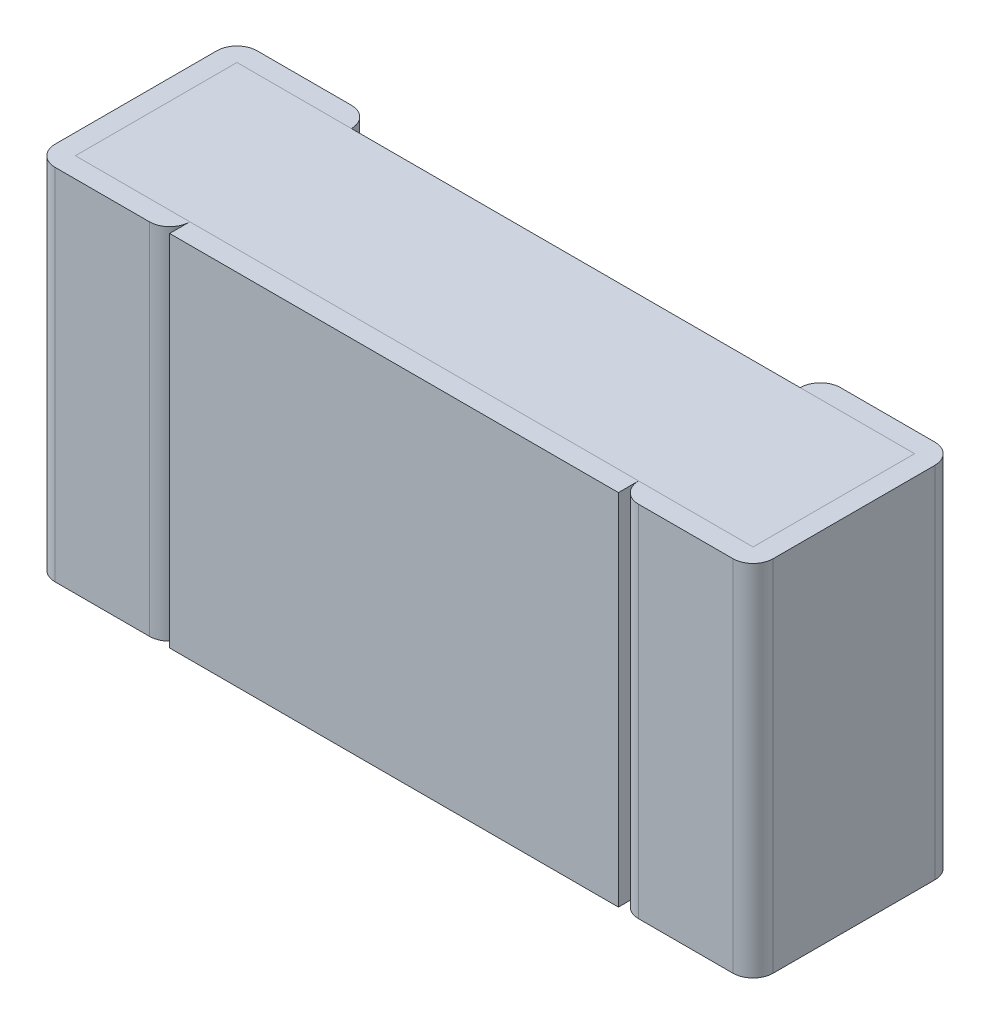
ISO-10303-21;
HEADER;
FILE_DESCRIPTION(('STEP AP214'),'2;1');
FILE_NAME('part.step','',(''),(''),'','','');
FILE_SCHEMA(('AUTOMOTIVE_DESIGN { 1 0 10303 214 1 1 1 1 }'));
ENDSEC;
DATA;
#1=APPLICATION_CONTEXT('core data for automotive mechanical design processes');
#2=APPLICATION_PROTOCOL_DEFINITION('international standard','automotive_design',2000,#1);
#3=PRODUCT_CONTEXT('',#1,'mechanical');
#4=PRODUCT('Part','Part','',(#3));
#5=PRODUCT_RELATED_PRODUCT_CATEGORY('part','',(#4));
#6=PRODUCT_DEFINITION_FORMATION('','',#4);
#7=PRODUCT_DEFINITION_CONTEXT('part definition',#1,'design');
#8=PRODUCT_DEFINITION('design','',#6,#7);
#9=PRODUCT_DEFINITION_SHAPE('','',#8);
#10=(LENGTH_UNIT() NAMED_UNIT(*) SI_UNIT(.MILLI.,.METRE.));
#11=(NAMED_UNIT(*) PLANE_ANGLE_UNIT() SI_UNIT($,.RADIAN.));
#12=(NAMED_UNIT(*) SI_UNIT($,.STERADIAN.) SOLID_ANGLE_UNIT());
#13=UNCERTAINTY_MEASURE_WITH_UNIT(LENGTH_MEASURE(1.E-05),#10,'distance_accuracy_value','');
#14=(GEOMETRIC_REPRESENTATION_CONTEXT(3) GLOBAL_UNCERTAINTY_ASSIGNED_CONTEXT((#13)) GLOBAL_UNIT_ASSIGNED_CONTEXT((#10,
#11,#12)) REPRESENTATION_CONTEXT('',''));
#15=CARTESIAN_POINT('',(0.,0.,0.));
#16=DIRECTION('',(0.,0.,1.));
#17=DIRECTION('',(1.,0.,0.));
#18=AXIS2_PLACEMENT_3D('',#15,#16,#17);
#19=CARTESIAN_POINT('',(-0.5,-0.4,0.45));
#20=DIRECTION('',(0.,0.,1.));
#21=DIRECTION('',(1.,0.,0.));
#22=AXIS2_PLACEMENT_3D('',#19,#20,#21);
#23=PLANE('',#22);
#24=DIRECTION('',(0.,1.,0.));
#25=VECTOR('',#24,1.);
#26=CARTESIAN_POINT('',(-0.5,-0.4,0.45));
#27=LINE('',#26,#25);
#28=CARTESIAN_POINT('',(-0.5,-0.4,0.45));
#29=VERTEX_POINT('',#28);
#30=CARTESIAN_POINT('',(-0.5,0.4,0.45));
#31=VERTEX_POINT('',#30);
#32=EDGE_CURVE('E289',#29,#31,#27,.T.);
#33=ORIENTED_EDGE('',*,*,#32,.F.);
#34=DIRECTION('',(1.,0.,0.));
#35=VECTOR('',#34,1.);
#36=CARTESIAN_POINT('',(-0.5,-0.4,0.45));
#37=LINE('',#36,#35);
#38=CARTESIAN_POINT('',(0.5,-0.4,0.45));
#39=VERTEX_POINT('',#38);
#40=EDGE_CURVE('E266',#29,#39,#37,.T.);
#41=ORIENTED_EDGE('',*,*,#40,.T.);
#42=DIRECTION('',(0.,1.,0.));
#43=VECTOR('',#42,1.);
#44=CARTESIAN_POINT('',(0.5,-0.4,0.45));
#45=LINE('',#44,#43);
#46=CARTESIAN_POINT('',(0.5,0.4,0.45));
#47=VERTEX_POINT('',#46);
#48=EDGE_CURVE('E11',#39,#47,#45,.T.);
#49=ORIENTED_EDGE('',*,*,#48,.T.);
#50=DIRECTION('',(1.,0.,0.));
#51=VECTOR('',#50,1.);
#52=CARTESIAN_POINT('',(-0.5,0.4,0.45));
#53=LINE('',#52,#51);
#54=EDGE_CURVE('E313',#31,#47,#53,.T.);
#55=ORIENTED_EDGE('',*,*,#54,.F.);
#56=EDGE_LOOP('',(#33,#41,#49,#55));
#57=FACE_BOUND('',#56,.T.);
#58=ADVANCED_FACE('F17',(#57),#23,.T.);
#59=CARTESIAN_POINT('',(0.5,-0.4,0.405));
#60=DIRECTION('',(1.,0.,0.));
#61=DIRECTION('',(0.,1.,0.));
#62=AXIS2_PLACEMENT_3D('',#59,#60,#61);
#63=PLANE('',#62);
#64=DIRECTION('',(0.,0.,1.));
#65=VECTOR('',#64,1.);
#66=CARTESIAN_POINT('',(0.5,-0.4,0.405));
#67=LINE('',#66,#65);
#68=CARTESIAN_POINT('',(0.5,-0.4,0.405));
#69=VERTEX_POINT('',#68);
#70=EDGE_CURVE('E270',#69,#39,#67,.T.);
#71=ORIENTED_EDGE('',*,*,#70,.F.);
#72=DIRECTION('',(0.,1.,0.));
#73=VECTOR('',#72,1.);
#74=CARTESIAN_POINT('',(0.5,-0.4,0.405));
#75=LINE('',#74,#73);
#76=CARTESIAN_POINT('',(0.5,0.4,0.405));
#77=VERTEX_POINT('',#76);
#78=EDGE_CURVE('E28',#69,#77,#75,.T.);
#79=ORIENTED_EDGE('',*,*,#78,.T.);
#80=DIRECTION('',(0.,0.,1.));
#81=VECTOR('',#80,1.);
#82=CARTESIAN_POINT('',(0.5,0.4,0.405));
#83=LINE('',#82,#81);
#84=EDGE_CURVE('E427',#77,#47,#83,.T.);
#85=ORIENTED_EDGE('',*,*,#84,.T.);
#86=ORIENTED_EDGE('',*,*,#48,.F.);
#87=EDGE_LOOP('',(#71,#79,#85,#86));
#88=FACE_BOUND('',#87,.T.);
#89=ADVANCED_FACE('F561',(#88),#63,.T.);
#90=CARTESIAN_POINT('',(0.545,-0.4,0.405));
#91=DIRECTION('',(0.,1.,0.));
#92=DIRECTION('',(-1.,0.,0.));
#93=AXIS2_PLACEMENT_3D('',#90,#91,#92);
#94=CYLINDRICAL_SURFACE('',#93,0.045);
#95=CARTESIAN_POINT('',(0.545,-0.4,0.405));
#96=DIRECTION('',(0.,1.,0.));
#97=DIRECTION('',(0.,0.,1.));
#98=AXIS2_PLACEMENT_3D('',#95,#96,#97);
#99=CIRCLE('',#98,0.045);
#100=CARTESIAN_POINT('',(0.545,-0.4,0.45));
#101=VERTEX_POINT('',#100);
#102=EDGE_CURVE('E394',#69,#101,#99,.T.);
#103=ORIENTED_EDGE('',*,*,#102,.T.);
#104=DIRECTION('',(0.,1.,0.));
#105=VECTOR('',#104,1.);
#106=CARTESIAN_POINT('',(0.545,-0.4,0.45));
#107=LINE('',#106,#105);
#108=CARTESIAN_POINT('',(0.545,0.4,0.45));
#109=VERTEX_POINT('',#108);
#110=EDGE_CURVE('E458',#101,#109,#107,.T.);
#111=ORIENTED_EDGE('',*,*,#110,.T.);
#112=CARTESIAN_POINT('',(0.545,0.4,0.405));
#113=DIRECTION('',(0.,1.,0.));
#114=DIRECTION('',(0.,0.,1.));
#115=AXIS2_PLACEMENT_3D('',#112,#113,#114);
#116=CIRCLE('',#115,0.045);
#117=EDGE_CURVE('E405',#77,#109,#116,.T.);
#118=ORIENTED_EDGE('',*,*,#117,.F.);
#119=ORIENTED_EDGE('',*,*,#78,.F.);
#120=EDGE_LOOP('',(#103,#111,#118,#119));
#121=FACE_BOUND('',#120,.T.);
#122=ADVANCED_FACE('F526',(#121),#94,.T.);
#123=CARTESIAN_POINT('',(0.5,-0.4,0.45));
#124=DIRECTION('',(0.,0.,1.));
#125=DIRECTION('',(1.,0.,0.));
#126=AXIS2_PLACEMENT_3D('',#123,#124,#125);
#127=PLANE('',#126);
#128=DIRECTION('',(1.,0.,0.));
#129=VECTOR('',#128,1.);
#130=CARTESIAN_POINT('',(0.5,0.4,0.45));
#131=LINE('',#130,#129);
#132=CARTESIAN_POINT('',(0.755,0.4,0.45));
#133=VERTEX_POINT('',#132);
#134=EDGE_CURVE('E409',#109,#133,#131,.T.);
#135=ORIENTED_EDGE('',*,*,#134,.F.);
#136=ORIENTED_EDGE('',*,*,#110,.F.);
#137=DIRECTION('',(1.,0.,0.));
#138=VECTOR('',#137,1.);
#139=CARTESIAN_POINT('',(0.5,-0.4,0.45));
#140=LINE('',#139,#138);
#141=CARTESIAN_POINT('',(0.755,-0.4,0.45));
#142=VERTEX_POINT('',#141);
#143=EDGE_CURVE('E390',#101,#142,#140,.T.);
#144=ORIENTED_EDGE('',*,*,#143,.T.);
#145=DIRECTION('',(0.,1.,0.));
#146=VECTOR('',#145,1.);
#147=CARTESIAN_POINT('',(0.755,-0.4,0.45));
#148=LINE('',#147,#146);
#149=EDGE_CURVE('E322',#142,#133,#148,.T.);
#150=ORIENTED_EDGE('',*,*,#149,.T.);
#151=EDGE_LOOP('',(#135,#136,#144,#150));
#152=FACE_BOUND('',#151,.T.);
#153=ADVANCED_FACE('F523',(#152),#127,.T.);
#154=CARTESIAN_POINT('',(0.755,-0.4,0.405));
#155=DIRECTION('',(0.,1.,0.));
#156=DIRECTION('',(1.,0.,0.));
#157=AXIS2_PLACEMENT_3D('',#154,#155,#156);
#158=CYLINDRICAL_SURFACE('',#157,0.045);
#159=DIRECTION('',(0.,1.,0.));
#160=VECTOR('',#159,1.);
#161=CARTESIAN_POINT('',(0.8,-0.4,0.405));
#162=LINE('',#161,#160);
#163=CARTESIAN_POINT('',(0.8,-0.4,0.405));
#164=VERTEX_POINT('',#163);
#165=CARTESIAN_POINT('',(0.8,0.4,0.405));
#166=VERTEX_POINT('',#165);
#167=EDGE_CURVE('E319',#164,#166,#162,.T.);
#168=ORIENTED_EDGE('',*,*,#167,.T.);
#169=CARTESIAN_POINT('',(0.755,0.4,0.405));
#170=DIRECTION('',(0.,-1.,0.));
#171=DIRECTION('',(0.,0.,1.));
#172=AXIS2_PLACEMENT_3D('',#169,#170,#171);
#173=CIRCLE('',#172,0.045);
#174=EDGE_CURVE('E450',#166,#133,#173,.T.);
#175=ORIENTED_EDGE('',*,*,#174,.T.);
#176=ORIENTED_EDGE('',*,*,#149,.F.);
#177=CARTESIAN_POINT('',(0.755,-0.4,0.405));
#178=DIRECTION('',(0.,-1.,0.));
#179=DIRECTION('',(0.,0.,1.));
#180=AXIS2_PLACEMENT_3D('',#177,#178,#179);
#181=CIRCLE('',#180,0.045);
#182=EDGE_CURVE('E395',#164,#142,#181,.T.);
#183=ORIENTED_EDGE('',*,*,#182,.F.);
#184=EDGE_LOOP('',(#168,#175,#176,#183));
#185=FACE_BOUND('',#184,.T.);
#186=ADVANCED_FACE('F511',(#185),#158,.T.);
#187=CARTESIAN_POINT('',(0.8,-0.4,0.));
#188=DIRECTION('',(1.,0.,0.));
#189=DIRECTION('',(0.,1.,0.));
#190=AXIS2_PLACEMENT_3D('',#187,#188,#189);
#191=PLANE('',#190);
#192=DIRECTION('',(0.,0.,1.));
#193=VECTOR('',#192,1.);
#194=CARTESIAN_POINT('',(0.8,-0.4,0.));
#195=LINE('',#194,#193);
#196=CARTESIAN_POINT('',(0.8,-0.4,0.045));
#197=VERTEX_POINT('',#196);
#198=EDGE_CURVE('E380',#197,#164,#195,.T.);
#199=ORIENTED_EDGE('',*,*,#198,.F.);
#200=DIRECTION('',(0.,1.,0.));
#201=VECTOR('',#200,1.);
#202=CARTESIAN_POINT('',(0.8,-0.4,0.045));
#203=LINE('',#202,#201);
#204=CARTESIAN_POINT('',(0.8,0.4,0.045));
#205=VERTEX_POINT('',#204);
#206=EDGE_CURVE('E323',#197,#205,#203,.T.);
#207=ORIENTED_EDGE('',*,*,#206,.T.);
#208=DIRECTION('',(0.,0.,1.));
#209=VECTOR('',#208,1.);
#210=CARTESIAN_POINT('',(0.8,0.4,0.));
#211=LINE('',#210,#209);
#212=EDGE_CURVE('E248',#205,#166,#211,.T.);
#213=ORIENTED_EDGE('',*,*,#212,.T.);
#214=ORIENTED_EDGE('',*,*,#167,.F.);
#215=EDGE_LOOP('',(#199,#207,#213,#214));
#216=FACE_BOUND('',#215,.T.);
#217=ADVANCED_FACE('F517',(#216),#191,.T.);
#218=CARTESIAN_POINT('',(0.755,-0.4,0.045));
#219=DIRECTION('',(0.,1.,0.));
#220=DIRECTION('',(1.,0.,0.));
#221=AXIS2_PLACEMENT_3D('',#218,#219,#220);
#222=CYLINDRICAL_SURFACE('',#221,0.045);
#223=CARTESIAN_POINT('',(0.755,-0.4,0.045));
#224=DIRECTION('',(0.,1.,0.));
#225=DIRECTION('',(0.,0.,1.));
#226=AXIS2_PLACEMENT_3D('',#223,#224,#225);
#227=CIRCLE('',#226,0.045);
#228=CARTESIAN_POINT('',(0.755,-0.4,0.));
#229=VERTEX_POINT('',#228);
#230=EDGE_CURVE('E376',#197,#229,#227,.T.);
#231=ORIENTED_EDGE('',*,*,#230,.T.);
#232=DIRECTION('',(0.,1.,0.));
#233=VECTOR('',#232,1.);
#234=CARTESIAN_POINT('',(0.755,-0.4,0.));
#235=LINE('',#234,#233);
#236=CARTESIAN_POINT('',(0.755,0.4,0.));
#237=VERTEX_POINT('',#236);
#238=EDGE_CURVE('E352',#229,#237,#235,.T.);
#239=ORIENTED_EDGE('',*,*,#238,.T.);
#240=CARTESIAN_POINT('',(0.755,0.4,0.045));
#241=DIRECTION('',(0.,1.,0.));
#242=DIRECTION('',(0.,0.,1.));
#243=AXIS2_PLACEMENT_3D('',#240,#241,#242);
#244=CIRCLE('',#243,0.045);
#245=EDGE_CURVE('E372',#205,#237,#244,.T.);
#246=ORIENTED_EDGE('',*,*,#245,.F.);
#247=ORIENTED_EDGE('',*,*,#206,.F.);
#248=EDGE_LOOP('',(#231,#239,#246,#247));
#249=FACE_BOUND('',#248,.T.);
#250=ADVANCED_FACE('F585',(#249),#222,.T.);
#251=CARTESIAN_POINT('',(0.5,-0.4,0.));
#252=DIRECTION('',(0.,0.,1.));
#253=DIRECTION('',(1.,0.,0.));
#254=AXIS2_PLACEMENT_3D('',#251,#252,#253);
#255=PLANE('',#254);
#256=ORIENTED_EDGE('',*,*,#238,.F.);
#257=DIRECTION('',(1.,0.,0.));
#258=VECTOR('',#257,1.);
#259=CARTESIAN_POINT('',(0.5,-0.4,0.));
#260=LINE('',#259,#258);
#261=CARTESIAN_POINT('',(0.545,-0.4,0.));
#262=VERTEX_POINT('',#261);
#263=EDGE_CURVE('E363',#262,#229,#260,.T.);
#264=ORIENTED_EDGE('',*,*,#263,.F.);
#265=DIRECTION('',(0.,1.,0.));
#266=VECTOR('',#265,1.);
#267=CARTESIAN_POINT('',(0.545,-0.4,0.));
#268=LINE('',#267,#266);
#269=CARTESIAN_POINT('',(0.545,0.4,0.));
#270=VERTEX_POINT('',#269);
#271=EDGE_CURVE('E369',#262,#270,#268,.T.);
#272=ORIENTED_EDGE('',*,*,#271,.T.);
#273=DIRECTION('',(1.,0.,0.));
#274=VECTOR('',#273,1.);
#275=CARTESIAN_POINT('',(0.5,0.4,0.));
#276=LINE('',#275,#274);
#277=EDGE_CURVE('E328',#270,#237,#276,.T.);
#278=ORIENTED_EDGE('',*,*,#277,.T.);
#279=EDGE_LOOP('',(#256,#264,#272,#278));
#280=FACE_BOUND('',#279,.T.);
#281=ADVANCED_FACE('F579',(#280),#255,.F.);
#282=CARTESIAN_POINT('',(0.545,-0.4,0.045));
#283=DIRECTION('',(0.,1.,0.));
#284=DIRECTION('',(-1.,0.,0.));
#285=AXIS2_PLACEMENT_3D('',#282,#283,#284);
#286=CYLINDRICAL_SURFACE('',#285,0.045);
#287=DIRECTION('',(0.,1.,0.));
#288=VECTOR('',#287,1.);
#289=CARTESIAN_POINT('',(0.5,-0.4,0.045));
#290=LINE('',#289,#288);
#291=CARTESIAN_POINT('',(0.5,-0.4,0.045));
#292=VERTEX_POINT('',#291);
#293=CARTESIAN_POINT('',(0.5,0.4,0.045));
#294=VERTEX_POINT('',#293);
#295=EDGE_CURVE('E381',#292,#294,#290,.T.);
#296=ORIENTED_EDGE('',*,*,#295,.T.);
#297=CARTESIAN_POINT('',(0.545,0.4,0.045));
#298=DIRECTION('',(0.,-1.,0.));
#299=DIRECTION('',(0.,0.,1.));
#300=AXIS2_PLACEMENT_3D('',#297,#298,#299);
#301=CIRCLE('',#300,0.045);
#302=EDGE_CURVE('E332',#294,#270,#301,.T.);
#303=ORIENTED_EDGE('',*,*,#302,.T.);
#304=ORIENTED_EDGE('',*,*,#271,.F.);
#305=CARTESIAN_POINT('',(0.545,-0.4,0.045));
#306=DIRECTION('',(0.,-1.,0.));
#307=DIRECTION('',(0.,0.,1.));
#308=AXIS2_PLACEMENT_3D('',#305,#306,#307);
#309=CIRCLE('',#308,0.045);
#310=EDGE_CURVE('E21',#292,#262,#309,.T.);
#311=ORIENTED_EDGE('',*,*,#310,.F.);
#312=EDGE_LOOP('',(#296,#303,#304,#311));
#313=FACE_BOUND('',#312,.T.);
#314=ADVANCED_FACE('F574',(#313),#286,.T.);
#315=CARTESIAN_POINT('',(-0.5,0.4,0.405));
#316=DIRECTION('',(0.,1.,0.));
#317=DIRECTION('',(1.,0.,0.));
#318=AXIS2_PLACEMENT_3D('',#315,#316,#317);
#319=PLANE('',#318);
#320=DIRECTION('',(1.,0.,0.));
#321=VECTOR('',#320,1.);
#322=CARTESIAN_POINT('',(-0.5,0.4,0.405));
#323=LINE('',#322,#321);
#324=CARTESIAN_POINT('',(-0.5,0.4,0.405));
#325=VERTEX_POINT('',#324);
#326=EDGE_CURVE('E353',#325,#77,#323,.T.);
#327=ORIENTED_EDGE('',*,*,#326,.F.);
#328=DIRECTION('',(0.,0.,1.));
#329=VECTOR('',#328,1.);
#330=CARTESIAN_POINT('',(-0.5,0.4,0.405));
#331=LINE('',#330,#329);
#332=EDGE_CURVE('E201',#325,#31,#331,.T.);
#333=ORIENTED_EDGE('',*,*,#332,.T.);
#334=ORIENTED_EDGE('',*,*,#54,.T.);
#335=ORIENTED_EDGE('',*,*,#84,.F.);
#336=EDGE_LOOP('',(#327,#333,#334,#335));
#337=FACE_BOUND('',#336,.T.);
#338=ADVANCED_FACE('F422',(#337),#319,.T.);
#339=CARTESIAN_POINT('',(0.5,0.4,0.));
#340=DIRECTION('',(0.,1.,0.));
#341=DIRECTION('',(1.,0.,0.));
#342=AXIS2_PLACEMENT_3D('',#339,#340,#341);
#343=PLANE('',#342);
#344=ORIENTED_EDGE('',*,*,#277,.F.);
#345=ORIENTED_EDGE('',*,*,#302,.F.);
#346=DIRECTION('',(1.,0.,0.));
#347=VECTOR('',#346,1.);
#348=CARTESIAN_POINT('',(-0.755,0.4,0.045));
#349=LINE('',#348,#347);
#350=CARTESIAN_POINT('',(0.755,0.4,0.045));
#351=VERTEX_POINT('',#350);
#352=EDGE_CURVE('E281',#294,#351,#349,.T.);
#353=ORIENTED_EDGE('',*,*,#352,.T.);
#354=DIRECTION('',(0.,0.,1.));
#355=VECTOR('',#354,1.);
#356=CARTESIAN_POINT('',(0.755,0.4,0.045));
#357=LINE('',#356,#355);
#358=CARTESIAN_POINT('',(0.755,0.4,0.405));
#359=VERTEX_POINT('',#358);
#360=EDGE_CURVE('E278',#351,#359,#357,.T.);
#361=ORIENTED_EDGE('',*,*,#360,.T.);
#362=DIRECTION('',(1.,0.,0.));
#363=VECTOR('',#362,1.);
#364=CARTESIAN_POINT('',(-0.755,0.4,0.405));
#365=LINE('',#364,#363);
#366=EDGE_CURVE('E282',#77,#359,#365,.T.);
#367=ORIENTED_EDGE('',*,*,#366,.F.);
#368=ORIENTED_EDGE('',*,*,#117,.T.);
#369=ORIENTED_EDGE('',*,*,#134,.T.);
#370=ORIENTED_EDGE('',*,*,#174,.F.);
#371=ORIENTED_EDGE('',*,*,#212,.F.);
#372=ORIENTED_EDGE('',*,*,#245,.T.);
#373=EDGE_LOOP('',(#344,#345,#353,#361,#367,#368,#369,#370,#371,#372));
#374=FACE_BOUND('',#373,.T.);
#375=ADVANCED_FACE('F469',(#374),#343,.T.);
#376=CARTESIAN_POINT('',(-0.5,-0.4,0.405));
#377=DIRECTION('',(1.,0.,0.));
#378=DIRECTION('',(0.,1.,0.));
#379=AXIS2_PLACEMENT_3D('',#376,#377,#378);
#380=PLANE('',#379);
#381=ORIENTED_EDGE('',*,*,#32,.T.);
#382=ORIENTED_EDGE('',*,*,#332,.F.);
#383=DIRECTION('',(0.,1.,0.));
#384=VECTOR('',#383,1.);
#385=CARTESIAN_POINT('',(-0.5,-0.4,0.405));
#386=LINE('',#385,#384);
#387=CARTESIAN_POINT('',(-0.5,-0.4,0.405));
#388=VERTEX_POINT('',#387);
#389=EDGE_CURVE('E357',#388,#325,#386,.T.);
#390=ORIENTED_EDGE('',*,*,#389,.F.);
#391=DIRECTION('',(0.,0.,1.));
#392=VECTOR('',#391,1.);
#393=CARTESIAN_POINT('',(-0.5,-0.4,0.405));
#394=LINE('',#393,#392);
#395=EDGE_CURVE('E269',#388,#29,#394,.T.);
#396=ORIENTED_EDGE('',*,*,#395,.T.);
#397=EDGE_LOOP('',(#381,#382,#390,#396));
#398=FACE_BOUND('',#397,.T.);
#399=ADVANCED_FACE('F425',(#398),#380,.F.);
#400=CARTESIAN_POINT('',(-0.5,-0.4,0.405));
#401=DIRECTION('',(0.,1.,0.));
#402=DIRECTION('',(1.,0.,0.));
#403=AXIS2_PLACEMENT_3D('',#400,#401,#402);
#404=PLANE('',#403);
#405=ORIENTED_EDGE('',*,*,#70,.T.);
#406=ORIENTED_EDGE('',*,*,#40,.F.);
#407=ORIENTED_EDGE('',*,*,#395,.F.);
#408=DIRECTION('',(1.,0.,0.));
#409=VECTOR('',#408,1.);
#410=CARTESIAN_POINT('',(-0.5,-0.4,0.405));
#411=LINE('',#410,#409);
#412=EDGE_CURVE('E228',#388,#69,#411,.T.);
#413=ORIENTED_EDGE('',*,*,#412,.T.);
#414=EDGE_LOOP('',(#405,#406,#407,#413));
#415=FACE_BOUND('',#414,.T.);
#416=ADVANCED_FACE('F530',(#415),#404,.F.);
#417=CARTESIAN_POINT('',(0.5,-0.4,0.));
#418=DIRECTION('',(0.,1.,0.));
#419=DIRECTION('',(1.,0.,0.));
#420=AXIS2_PLACEMENT_3D('',#417,#418,#419);
#421=PLANE('',#420);
#422=ORIENTED_EDGE('',*,*,#230,.F.);
#423=ORIENTED_EDGE('',*,*,#198,.T.);
#424=ORIENTED_EDGE('',*,*,#182,.T.);
#425=ORIENTED_EDGE('',*,*,#143,.F.);
#426=ORIENTED_EDGE('',*,*,#102,.F.);
#427=DIRECTION('',(1.,0.,0.));
#428=VECTOR('',#427,1.);
#429=CARTESIAN_POINT('',(-0.755,-0.4,0.405));
#430=LINE('',#429,#428);
#431=CARTESIAN_POINT('',(0.755,-0.4,0.405));
#432=VERTEX_POINT('',#431);
#433=EDGE_CURVE('E316',#69,#432,#430,.T.);
#434=ORIENTED_EDGE('',*,*,#433,.T.);
#435=DIRECTION('',(0.,0.,1.));
#436=VECTOR('',#435,1.);
#437=CARTESIAN_POINT('',(0.755,-0.4,0.045));
#438=LINE('',#437,#436);
#439=CARTESIAN_POINT('',(0.755,-0.4,0.045));
#440=VERTEX_POINT('',#439);
#441=EDGE_CURVE('E263',#440,#432,#438,.T.);
#442=ORIENTED_EDGE('',*,*,#441,.F.);
#443=DIRECTION('',(1.,0.,0.));
#444=VECTOR('',#443,1.);
#445=CARTESIAN_POINT('',(-0.755,-0.4,0.045));
#446=LINE('',#445,#444);
#447=EDGE_CURVE('E260',#292,#440,#446,.T.);
#448=ORIENTED_EDGE('',*,*,#447,.F.);
#449=ORIENTED_EDGE('',*,*,#310,.T.);
#450=ORIENTED_EDGE('',*,*,#263,.T.);
#451=EDGE_LOOP('',(#422,#423,#424,#425,#426,#434,#442,#448,#449,#450));
#452=FACE_BOUND('',#451,.T.);
#453=ADVANCED_FACE('F507',(#452),#421,.F.);
#454=CARTESIAN_POINT('',(-0.755,-0.4,0.045));
#455=DIRECTION('',(0.,0.,1.));
#456=DIRECTION('',(1.,0.,0.));
#457=AXIS2_PLACEMENT_3D('',#454,#455,#456);
#458=PLANE('',#457);
#459=DIRECTION('',(1.,0.,0.));
#460=VECTOR('',#459,1.);
#461=CARTESIAN_POINT('',(-0.755,0.4,0.045));
#462=LINE('',#461,#460);
#463=CARTESIAN_POINT('',(-0.5,0.4,0.045));
#464=VERTEX_POINT('',#463);
#465=EDGE_CURVE('E386',#464,#294,#462,.T.);
#466=ORIENTED_EDGE('',*,*,#465,.T.);
#467=ORIENTED_EDGE('',*,*,#295,.F.);
#468=DIRECTION('',(1.,0.,0.));
#469=VECTOR('',#468,1.);
#470=CARTESIAN_POINT('',(-0.755,-0.4,0.045));
#471=LINE('',#470,#469);
#472=CARTESIAN_POINT('',(-0.5,-0.4,0.045));
#473=VERTEX_POINT('',#472);
#474=EDGE_CURVE('E264',#473,#292,#471,.T.);
#475=ORIENTED_EDGE('',*,*,#474,.F.);
#476=DIRECTION('',(0.,1.,0.));
#477=VECTOR('',#476,1.);
#478=CARTESIAN_POINT('',(-0.5,-0.4,0.045));
#479=LINE('',#478,#477);
#480=EDGE_CURVE('E292',#473,#464,#479,.T.);
#481=ORIENTED_EDGE('',*,*,#480,.T.);
#482=EDGE_LOOP('',(#466,#467,#475,#481));
#483=FACE_BOUND('',#482,.T.);
#484=ADVANCED_FACE('F476',(#483),#458,.F.);
#485=CARTESIAN_POINT('',(-0.755,0.4,0.045));
#486=DIRECTION('',(0.,1.,0.));
#487=DIRECTION('',(1.,0.,0.));
#488=AXIS2_PLACEMENT_3D('',#485,#486,#487);
#489=PLANE('',#488);
#490=DIRECTION('',(1.,0.,0.));
#491=VECTOR('',#490,1.);
#492=CARTESIAN_POINT('',(-0.755,0.4,0.045));
#493=LINE('',#492,#491);
#494=CARTESIAN_POINT('',(-0.755,0.4,0.045));
#495=VERTEX_POINT('',#494);
#496=EDGE_CURVE('E303',#495,#464,#493,.T.);
#497=ORIENTED_EDGE('',*,*,#496,.F.);
#498=DIRECTION('',(0.,0.,1.));
#499=VECTOR('',#498,1.);
#500=CARTESIAN_POINT('',(-0.755,0.4,0.045));
#501=LINE('',#500,#499);
#502=CARTESIAN_POINT('',(-0.755,0.4,0.405));
#503=VERTEX_POINT('',#502);
#504=EDGE_CURVE('E310',#495,#503,#501,.T.);
#505=ORIENTED_EDGE('',*,*,#504,.T.);
#506=DIRECTION('',(1.,0.,0.));
#507=VECTOR('',#506,1.);
#508=CARTESIAN_POINT('',(-0.755,0.4,0.405));
#509=LINE('',#508,#507);
#510=EDGE_CURVE('E402',#503,#325,#509,.T.);
#511=ORIENTED_EDGE('',*,*,#510,.T.);
#512=ORIENTED_EDGE('',*,*,#326,.T.);
#513=ORIENTED_EDGE('',*,*,#366,.T.);
#514=ORIENTED_EDGE('',*,*,#360,.F.);
#515=ORIENTED_EDGE('',*,*,#352,.F.);
#516=ORIENTED_EDGE('',*,*,#465,.F.);
#517=EDGE_LOOP('',(#497,#505,#511,#512,#513,#514,#515,#516));
#518=FACE_BOUND('',#517,.T.);
#519=ADVANCED_FACE('F464',(#518),#489,.T.);
#520=CARTESIAN_POINT('',(-0.545,-0.4,0.405));
#521=DIRECTION('',(0.,1.,0.));
#522=DIRECTION('',(1.,0.,0.));
#523=AXIS2_PLACEMENT_3D('',#520,#521,#522);
#524=CYLINDRICAL_SURFACE('',#523,0.045);
#525=ORIENTED_EDGE('',*,*,#389,.T.);
#526=CARTESIAN_POINT('',(-0.545,0.4,0.405));
#527=DIRECTION('',(0.,-1.,0.));
#528=DIRECTION('',(0.,0.,1.));
#529=AXIS2_PLACEMENT_3D('',#526,#527,#528);
#530=CIRCLE('',#529,0.045);
#531=CARTESIAN_POINT('',(-0.545,0.4,0.45));
#532=VERTEX_POINT('',#531);
#533=EDGE_CURVE('E399',#325,#532,#530,.T.);
#534=ORIENTED_EDGE('',*,*,#533,.T.);
#535=DIRECTION('',(0.,1.,0.));
#536=VECTOR('',#535,1.);
#537=CARTESIAN_POINT('',(-0.545,-0.4,0.45));
#538=LINE('',#537,#536);
#539=CARTESIAN_POINT('',(-0.545,-0.4,0.45));
#540=VERTEX_POINT('',#539);
#541=EDGE_CURVE('E211',#540,#532,#538,.T.);
#542=ORIENTED_EDGE('',*,*,#541,.F.);
#543=CARTESIAN_POINT('',(-0.545,-0.4,0.405));
#544=DIRECTION('',(0.,-1.,0.));
#545=DIRECTION('',(0.,0.,1.));
#546=AXIS2_PLACEMENT_3D('',#543,#544,#545);
#547=CIRCLE('',#546,0.045);
#548=EDGE_CURVE('E233',#388,#540,#547,.T.);
#549=ORIENTED_EDGE('',*,*,#548,.F.);
#550=EDGE_LOOP('',(#525,#534,#542,#549));
#551=FACE_BOUND('',#550,.T.);
#552=ADVANCED_FACE('F548',(#551),#524,.T.);
#553=CARTESIAN_POINT('',(-0.8,-0.4,0.45));
#554=DIRECTION('',(0.,0.,1.));
#555=DIRECTION('',(1.,0.,0.));
#556=AXIS2_PLACEMENT_3D('',#553,#554,#555);
#557=PLANE('',#556);
#558=DIRECTION('',(1.,0.,0.));
#559=VECTOR('',#558,1.);
#560=CARTESIAN_POINT('',(-0.8,0.4,0.45));
#561=LINE('',#560,#559);
#562=CARTESIAN_POINT('',(-0.755,0.4,0.45));
#563=VERTEX_POINT('',#562);
#564=EDGE_CURVE('E253',#563,#532,#561,.T.);
#565=ORIENTED_EDGE('',*,*,#564,.F.);
#566=DIRECTION('',(0.,1.,0.));
#567=VECTOR('',#566,1.);
#568=CARTESIAN_POINT('',(-0.755,-0.4,0.45));
#569=LINE('',#568,#567);
#570=CARTESIAN_POINT('',(-0.755,-0.4,0.45));
#571=VERTEX_POINT('',#570);
#572=EDGE_CURVE('E327',#571,#563,#569,.T.);
#573=ORIENTED_EDGE('',*,*,#572,.F.);
#574=DIRECTION('',(1.,0.,0.));
#575=VECTOR('',#574,1.);
#576=CARTESIAN_POINT('',(-0.8,-0.4,0.45));
#577=LINE('',#576,#575);
#578=EDGE_CURVE('E277',#571,#540,#577,.T.);
#579=ORIENTED_EDGE('',*,*,#578,.T.);
#580=ORIENTED_EDGE('',*,*,#541,.T.);
#581=EDGE_LOOP('',(#565,#573,#579,#580));
#582=FACE_BOUND('',#581,.T.);
#583=ADVANCED_FACE('F546',(#582),#557,.T.);
#584=CARTESIAN_POINT('',(-0.755,-0.4,0.045));
#585=DIRECTION('',(0.,1.,0.));
#586=DIRECTION('',(1.,0.,0.));
#587=AXIS2_PLACEMENT_3D('',#584,#585,#586);
#588=PLANE('',#587);
#589=ORIENTED_EDGE('',*,*,#474,.T.);
#590=ORIENTED_EDGE('',*,*,#447,.T.);
#591=ORIENTED_EDGE('',*,*,#441,.T.);
#592=ORIENTED_EDGE('',*,*,#433,.F.);
#593=ORIENTED_EDGE('',*,*,#412,.F.);
#594=DIRECTION('',(1.,0.,0.));
#595=VECTOR('',#594,1.);
#596=CARTESIAN_POINT('',(-0.755,-0.4,0.405));
#597=LINE('',#596,#595);
#598=CARTESIAN_POINT('',(-0.755,-0.4,0.405));
#599=VERTEX_POINT('',#598);
#600=EDGE_CURVE('E219',#599,#388,#597,.T.);
#601=ORIENTED_EDGE('',*,*,#600,.F.);
#602=DIRECTION('',(0.,0.,1.));
#603=VECTOR('',#602,1.);
#604=CARTESIAN_POINT('',(-0.755,-0.4,0.045));
#605=LINE('',#604,#603);
#606=CARTESIAN_POINT('',(-0.755,-0.4,0.045));
#607=VERTEX_POINT('',#606);
#608=EDGE_CURVE('E224',#607,#599,#605,.T.);
#609=ORIENTED_EDGE('',*,*,#608,.F.);
#610=DIRECTION('',(1.,0.,0.));
#611=VECTOR('',#610,1.);
#612=CARTESIAN_POINT('',(-0.755,-0.4,0.045));
#613=LINE('',#612,#611);
#614=EDGE_CURVE('E237',#607,#473,#613,.T.);
#615=ORIENTED_EDGE('',*,*,#614,.T.);
#616=EDGE_LOOP('',(#589,#590,#591,#592,#593,#601,#609,#615));
#617=FACE_BOUND('',#616,.T.);
#618=ADVANCED_FACE('F222',(#617),#588,.F.);
#619=CARTESIAN_POINT('',(-0.545,-0.4,0.045));
#620=DIRECTION('',(0.,1.,0.));
#621=DIRECTION('',(1.,0.,0.));
#622=AXIS2_PLACEMENT_3D('',#619,#620,#621);
#623=CYLINDRICAL_SURFACE('',#622,0.045);
#624=CARTESIAN_POINT('',(-0.545,-0.4,0.045));
#625=DIRECTION('',(0.,1.,0.));
#626=DIRECTION('',(0.,0.,1.));
#627=AXIS2_PLACEMENT_3D('',#624,#625,#626);
#628=CIRCLE('',#627,0.045);
#629=CARTESIAN_POINT('',(-0.545,-0.4,0.));
#630=VERTEX_POINT('',#629);
#631=EDGE_CURVE('E244',#473,#630,#628,.T.);
#632=ORIENTED_EDGE('',*,*,#631,.T.);
#633=DIRECTION('',(0.,1.,0.));
#634=VECTOR('',#633,1.);
#635=CARTESIAN_POINT('',(-0.545,-0.4,0.));
#636=LINE('',#635,#634);
#637=CARTESIAN_POINT('',(-0.545,0.4,0.));
#638=VERTEX_POINT('',#637);
#639=EDGE_CURVE('E290',#630,#638,#636,.T.);
#640=ORIENTED_EDGE('',*,*,#639,.T.);
#641=CARTESIAN_POINT('',(-0.545,0.4,0.045));
#642=DIRECTION('',(0.,1.,0.));
#643=DIRECTION('',(0.,0.,1.));
#644=AXIS2_PLACEMENT_3D('',#641,#642,#643);
#645=CIRCLE('',#644,0.045);
#646=EDGE_CURVE('E293',#464,#638,#645,.T.);
#647=ORIENTED_EDGE('',*,*,#646,.F.);
#648=ORIENTED_EDGE('',*,*,#480,.F.);
#649=EDGE_LOOP('',(#632,#640,#647,#648));
#650=FACE_BOUND('',#649,.T.);
#651=ADVANCED_FACE('F477',(#650),#623,.T.);
#652=CARTESIAN_POINT('',(-0.8,-0.4,0.));
#653=DIRECTION('',(0.,0.,1.));
#654=DIRECTION('',(1.,0.,0.));
#655=AXIS2_PLACEMENT_3D('',#652,#653,#654);
#656=PLANE('',#655);
#657=ORIENTED_EDGE('',*,*,#639,.F.);
#658=DIRECTION('',(1.,0.,0.));
#659=VECTOR('',#658,1.);
#660=CARTESIAN_POINT('',(-0.8,-0.4,0.));
#661=LINE('',#660,#659);
#662=CARTESIAN_POINT('',(-0.755,-0.4,0.));
#663=VERTEX_POINT('',#662);
#664=EDGE_CURVE('E341',#663,#630,#661,.T.);
#665=ORIENTED_EDGE('',*,*,#664,.F.);
#666=DIRECTION('',(0.,1.,0.));
#667=VECTOR('',#666,1.);
#668=CARTESIAN_POINT('',(-0.755,-0.4,0.));
#669=LINE('',#668,#667);
#670=CARTESIAN_POINT('',(-0.755,0.4,0.));
#671=VERTEX_POINT('',#670);
#672=EDGE_CURVE('E340',#663,#671,#669,.T.);
#673=ORIENTED_EDGE('',*,*,#672,.T.);
#674=DIRECTION('',(1.,0.,0.));
#675=VECTOR('',#674,1.);
#676=CARTESIAN_POINT('',(-0.8,0.4,0.));
#677=LINE('',#676,#675);
#678=EDGE_CURVE('E250',#671,#638,#677,.T.);
#679=ORIENTED_EDGE('',*,*,#678,.T.);
#680=EDGE_LOOP('',(#657,#665,#673,#679));
#681=FACE_BOUND('',#680,.T.);
#682=ADVANCED_FACE('F19',(#681),#656,.F.);
#683=CARTESIAN_POINT('',(-0.8,0.4,0.));
#684=DIRECTION('',(0.,1.,0.));
#685=DIRECTION('',(1.,0.,0.));
#686=AXIS2_PLACEMENT_3D('',#683,#684,#685);
#687=PLANE('',#686);
#688=ORIENTED_EDGE('',*,*,#678,.F.);
#689=CARTESIAN_POINT('',(-0.755,0.4,0.045));
#690=DIRECTION('',(0.,-1.,0.));
#691=DIRECTION('',(0.,0.,1.));
#692=AXIS2_PLACEMENT_3D('',#689,#690,#691);
#693=CIRCLE('',#692,0.045);
#694=CARTESIAN_POINT('',(-0.8,0.4,0.045));
#695=VERTEX_POINT('',#694);
#696=EDGE_CURVE('E336',#695,#671,#693,.T.);
#697=ORIENTED_EDGE('',*,*,#696,.F.);
#698=DIRECTION('',(0.,0.,1.));
#699=VECTOR('',#698,1.);
#700=CARTESIAN_POINT('',(-0.8,0.4,0.));
#701=LINE('',#700,#699);
#702=CARTESIAN_POINT('',(-0.8,0.4,0.405));
#703=VERTEX_POINT('',#702);
#704=EDGE_CURVE('E259',#695,#703,#701,.T.);
#705=ORIENTED_EDGE('',*,*,#704,.T.);
#706=CARTESIAN_POINT('',(-0.755,0.4,0.405));
#707=DIRECTION('',(0.,1.,0.));
#708=DIRECTION('',(0.,0.,1.));
#709=AXIS2_PLACEMENT_3D('',#706,#707,#708);
#710=CIRCLE('',#709,0.045);
#711=EDGE_CURVE('E254',#703,#563,#710,.T.);
#712=ORIENTED_EDGE('',*,*,#711,.T.);
#713=ORIENTED_EDGE('',*,*,#564,.T.);
#714=ORIENTED_EDGE('',*,*,#533,.F.);
#715=ORIENTED_EDGE('',*,*,#510,.F.);
#716=ORIENTED_EDGE('',*,*,#504,.F.);
#717=ORIENTED_EDGE('',*,*,#496,.T.);
#718=ORIENTED_EDGE('',*,*,#646,.T.);
#719=EDGE_LOOP('',(#688,#697,#705,#712,#713,#714,#715,#716,#717,#718));
#720=FACE_BOUND('',#719,.T.);
#721=ADVANCED_FACE('F478',(#720),#687,.T.);
#722=CARTESIAN_POINT('',(-0.755,-0.4,0.405));
#723=DIRECTION('',(0.,1.,0.));
#724=DIRECTION('',(-1.,0.,0.));
#725=AXIS2_PLACEMENT_3D('',#722,#723,#724);
#726=CYLINDRICAL_SURFACE('',#725,0.045);
#727=CARTESIAN_POINT('',(-0.755,-0.4,0.405));
#728=DIRECTION('',(0.,1.,0.));
#729=DIRECTION('',(0.,0.,1.));
#730=AXIS2_PLACEMENT_3D('',#727,#728,#729);
#731=CIRCLE('',#730,0.045);
#732=CARTESIAN_POINT('',(-0.8,-0.4,0.405));
#733=VERTEX_POINT('',#732);
#734=EDGE_CURVE('E335',#733,#571,#731,.T.);
#735=ORIENTED_EDGE('',*,*,#734,.T.);
#736=ORIENTED_EDGE('',*,*,#572,.T.);
#737=ORIENTED_EDGE('',*,*,#711,.F.);
#738=DIRECTION('',(0.,1.,0.));
#739=VECTOR('',#738,1.);
#740=CARTESIAN_POINT('',(-0.8,-0.4,0.405));
#741=LINE('',#740,#739);
#742=EDGE_CURVE('E255',#733,#703,#741,.T.);
#743=ORIENTED_EDGE('',*,*,#742,.F.);
#744=EDGE_LOOP('',(#735,#736,#737,#743));
#745=FACE_BOUND('',#744,.T.);
#746=ADVANCED_FACE('F544',(#745),#726,.T.);
#747=CARTESIAN_POINT('',(-0.755,-0.4,0.045));
#748=DIRECTION('',(0.,1.,0.));
#749=DIRECTION('',(-1.,0.,0.));
#750=AXIS2_PLACEMENT_3D('',#747,#748,#749);
#751=CYLINDRICAL_SURFACE('',#750,0.045);
#752=DIRECTION('',(0.,1.,0.));
#753=VECTOR('',#752,1.);
#754=CARTESIAN_POINT('',(-0.8,-0.4,0.045));
#755=LINE('',#754,#753);
#756=CARTESIAN_POINT('',(-0.8,-0.4,0.045));
#757=VERTEX_POINT('',#756);
#758=EDGE_CURVE('E283',#757,#695,#755,.T.);
#759=ORIENTED_EDGE('',*,*,#758,.T.);
#760=ORIENTED_EDGE('',*,*,#696,.T.);
#761=ORIENTED_EDGE('',*,*,#672,.F.);
#762=CARTESIAN_POINT('',(-0.755,-0.4,0.045));
#763=DIRECTION('',(0.,-1.,0.));
#764=DIRECTION('',(0.,0.,1.));
#765=AXIS2_PLACEMENT_3D('',#762,#763,#764);
#766=CIRCLE('',#765,0.045);
#767=EDGE_CURVE('E385',#757,#663,#766,.T.);
#768=ORIENTED_EDGE('',*,*,#767,.F.);
#769=EDGE_LOOP('',(#759,#760,#761,#768));
#770=FACE_BOUND('',#769,.T.);
#771=ADVANCED_FACE('F539',(#770),#751,.T.);
#772=CARTESIAN_POINT('',(-0.8,-0.4,0.));
#773=DIRECTION('',(0.,1.,0.));
#774=DIRECTION('',(1.,0.,0.));
#775=AXIS2_PLACEMENT_3D('',#772,#773,#774);
#776=PLANE('',#775);
#777=ORIENTED_EDGE('',*,*,#631,.F.);
#778=ORIENTED_EDGE('',*,*,#614,.F.);
#779=ORIENTED_EDGE('',*,*,#608,.T.);
#780=ORIENTED_EDGE('',*,*,#600,.T.);
#781=ORIENTED_EDGE('',*,*,#548,.T.);
#782=ORIENTED_EDGE('',*,*,#578,.F.);
#783=ORIENTED_EDGE('',*,*,#734,.F.);
#784=DIRECTION('',(0.,0.,1.));
#785=VECTOR('',#784,1.);
#786=CARTESIAN_POINT('',(-0.8,-0.4,0.));
#787=LINE('',#786,#785);
#788=EDGE_CURVE('E274',#757,#733,#787,.T.);
#789=ORIENTED_EDGE('',*,*,#788,.F.);
#790=ORIENTED_EDGE('',*,*,#767,.T.);
#791=ORIENTED_EDGE('',*,*,#664,.T.);
#792=EDGE_LOOP('',(#777,#778,#779,#780,#781,#782,#783,#789,#790,#791));
#793=FACE_BOUND('',#792,.T.);
#794=ADVANCED_FACE('F236',(#793),#776,.F.);
#795=CARTESIAN_POINT('',(-0.8,-0.4,0.));
#796=DIRECTION('',(1.,0.,0.));
#797=DIRECTION('',(0.,1.,0.));
#798=AXIS2_PLACEMENT_3D('',#795,#796,#797);
#799=PLANE('',#798);
#800=ORIENTED_EDGE('',*,*,#742,.T.);
#801=ORIENTED_EDGE('',*,*,#704,.F.);
#802=ORIENTED_EDGE('',*,*,#758,.F.);
#803=ORIENTED_EDGE('',*,*,#788,.T.);
#804=EDGE_LOOP('',(#800,#801,#802,#803));
#805=FACE_BOUND('',#804,.T.);
#806=ADVANCED_FACE('F541',(#805),#799,.F.);
#807=CLOSED_SHELL('',(#58,#89,#122,#153,#186,#217,#250,#281,#314,#338,#375,#399,#416,#453,#484,
#519,#552,#583,#618,#651,#682,#721,#746,#771,#794,#806));
#808=MANIFOLD_SOLID_BREP('B1',#807);
#809=ADVANCED_BREP_SHAPE_REPRESENTATION('',(#18,#808),#14);
#810=SHAPE_DEFINITION_REPRESENTATION(#9,#809);
ENDSEC;
END-ISO-10303-21;
